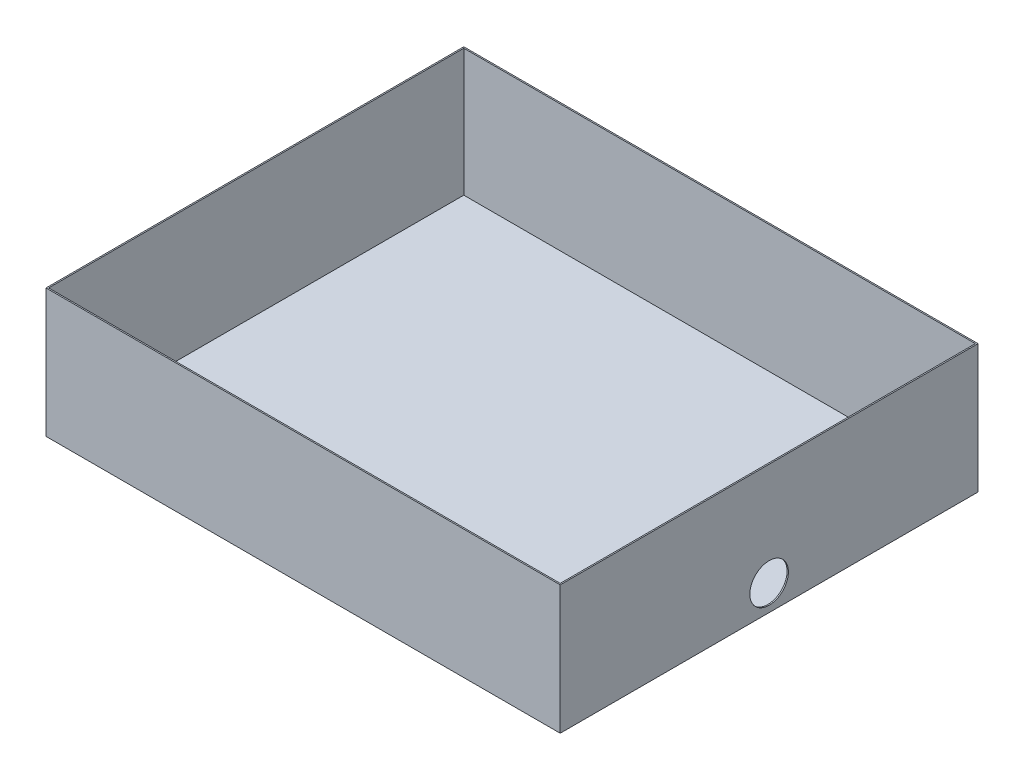
ISO-10303-21;
HEADER;
FILE_DESCRIPTION(('STEP AP214'),'2;1');
FILE_NAME('part.step','',(''),(''),'','','');
FILE_SCHEMA(('AUTOMOTIVE_DESIGN { 1 0 10303 214 1 1 1 1 }'));
ENDSEC;
DATA;
#1=APPLICATION_CONTEXT('core data for automotive mechanical design processes');
#2=APPLICATION_PROTOCOL_DEFINITION('international standard','automotive_design',2000,#1);
#3=PRODUCT_CONTEXT('',#1,'mechanical');
#4=PRODUCT('Part','Part','',(#3));
#5=PRODUCT_RELATED_PRODUCT_CATEGORY('part','',(#4));
#6=PRODUCT_DEFINITION_FORMATION('','',#4);
#7=PRODUCT_DEFINITION_CONTEXT('part definition',#1,'design');
#8=PRODUCT_DEFINITION('design','',#6,#7);
#9=PRODUCT_DEFINITION_SHAPE('','',#8);
#10=(LENGTH_UNIT() NAMED_UNIT(*) SI_UNIT(.MILLI.,.METRE.));
#11=(NAMED_UNIT(*) PLANE_ANGLE_UNIT() SI_UNIT($,.RADIAN.));
#12=(NAMED_UNIT(*) SI_UNIT($,.STERADIAN.) SOLID_ANGLE_UNIT());
#13=UNCERTAINTY_MEASURE_WITH_UNIT(LENGTH_MEASURE(1.E-05),#10,'distance_accuracy_value','');
#14=(GEOMETRIC_REPRESENTATION_CONTEXT(3) GLOBAL_UNCERTAINTY_ASSIGNED_CONTEXT((#13)) GLOBAL_UNIT_ASSIGNED_CONTEXT((#10,
#11,#12)) REPRESENTATION_CONTEXT('',''));
#15=CARTESIAN_POINT('',(0.,0.,0.));
#16=DIRECTION('',(0.,0.,1.));
#17=DIRECTION('',(1.,0.,0.));
#18=AXIS2_PLACEMENT_3D('',#15,#16,#17);
#19=CARTESIAN_POINT('',(0.,200.,0.));
#20=DIRECTION('',(1.,0.,0.));
#21=DIRECTION('',(0.,0.,-1.));
#22=AXIS2_PLACEMENT_3D('',#19,#20,#21);
#23=PLANE('',#22);
#24=DIRECTION('',(0.,0.,1.));
#25=VECTOR('',#24,1.);
#26=CARTESIAN_POINT('',(0.,0.,0.));
#27=LINE('',#26,#25);
#28=CARTESIAN_POINT('',(0.,0.,-650.));
#29=VERTEX_POINT('',#28);
#30=CARTESIAN_POINT('',(0.,0.,0.));
#31=VERTEX_POINT('',#30);
#32=EDGE_CURVE('E161',#29,#31,#27,.T.);
#33=ORIENTED_EDGE('',*,*,#32,.T.);
#34=DIRECTION('',(0.,-1.,0.));
#35=VECTOR('',#34,1.);
#36=CARTESIAN_POINT('',(0.,200.,0.));
#37=LINE('',#36,#35);
#38=CARTESIAN_POINT('',(0.,200.,0.));
#39=VERTEX_POINT('',#38);
#40=EDGE_CURVE('E11',#39,#31,#37,.T.);
#41=ORIENTED_EDGE('',*,*,#40,.F.);
#42=DIRECTION('',(0.,0.,1.));
#43=VECTOR('',#42,1.);
#44=CARTESIAN_POINT('',(0.,200.,0.));
#45=LINE('',#44,#43);
#46=CARTESIAN_POINT('',(0.,200.,-650.));
#47=VERTEX_POINT('',#46);
#48=EDGE_CURVE('E167',#47,#39,#45,.T.);
#49=ORIENTED_EDGE('',*,*,#48,.F.);
#50=DIRECTION('',(0.,-1.,0.));
#51=VECTOR('',#50,1.);
#52=CARTESIAN_POINT('',(0.,200.,-650.));
#53=LINE('',#52,#51);
#54=EDGE_CURVE('E177',#47,#29,#53,.T.);
#55=ORIENTED_EDGE('',*,*,#54,.T.);
#56=EDGE_LOOP('',(#33,#41,#49,#55));
#57=FACE_BOUND('',#56,.T.);
#58=ADVANCED_FACE('F39',(#57),#23,.F.);
#59=CARTESIAN_POINT('',(0.,200.,0.));
#60=DIRECTION('',(0.,0.,-1.));
#61=DIRECTION('',(-1.,0.,0.));
#62=AXIS2_PLACEMENT_3D('',#59,#60,#61);
#63=PLANE('',#62);
#64=DIRECTION('',(1.,0.,0.));
#65=VECTOR('',#64,1.);
#66=CARTESIAN_POINT('',(0.,0.,0.));
#67=LINE('',#66,#65);
#68=CARTESIAN_POINT('',(800.,0.,0.));
#69=VERTEX_POINT('',#68);
#70=EDGE_CURVE('E181',#31,#69,#67,.T.);
#71=ORIENTED_EDGE('',*,*,#70,.T.);
#72=DIRECTION('',(0.,-1.,0.));
#73=VECTOR('',#72,1.);
#74=CARTESIAN_POINT('',(800.,200.,0.));
#75=LINE('',#74,#73);
#76=CARTESIAN_POINT('',(800.,200.,0.));
#77=VERTEX_POINT('',#76);
#78=EDGE_CURVE('E47',#77,#69,#75,.T.);
#79=ORIENTED_EDGE('',*,*,#78,.F.);
#80=DIRECTION('',(1.,0.,0.));
#81=VECTOR('',#80,1.);
#82=CARTESIAN_POINT('',(0.,200.,0.));
#83=LINE('',#82,#81);
#84=EDGE_CURVE('E91',#39,#77,#83,.T.);
#85=ORIENTED_EDGE('',*,*,#84,.F.);
#86=ORIENTED_EDGE('',*,*,#40,.T.);
#87=EDGE_LOOP('',(#71,#79,#85,#86));
#88=FACE_BOUND('',#87,.T.);
#89=ADVANCED_FACE('F216',(#88),#63,.F.);
#90=CARTESIAN_POINT('',(800.,200.,0.));
#91=DIRECTION('',(-1.,0.,0.));
#92=DIRECTION('',(0.,0.,1.));
#93=AXIS2_PLACEMENT_3D('',#90,#91,#92);
#94=PLANE('',#93);
#95=CARTESIAN_POINT('',(800.,40.,-325.));
#96=DIRECTION('',(1.,0.,0.));
#97=DIRECTION('',(0.,0.,-1.));
#98=AXIS2_PLACEMENT_3D('',#95,#96,#97);
#99=CIRCLE('',#98,30.);
#100=CARTESIAN_POINT('',(800.,40.,-355.));
#101=VERTEX_POINT('',#100);
#102=EDGE_CURVE('E311',#101,#101,#99,.T.);
#103=ORIENTED_EDGE('',*,*,#102,.F.);
#104=EDGE_LOOP('',(#103));
#105=FACE_BOUND('',#104,.T.);
#106=DIRECTION('',(0.,0.,-1.));
#107=VECTOR('',#106,1.);
#108=CARTESIAN_POINT('',(800.,0.,0.));
#109=LINE('',#108,#107);
#110=CARTESIAN_POINT('',(800.,0.,-650.));
#111=VERTEX_POINT('',#110);
#112=EDGE_CURVE('E184',#69,#111,#109,.T.);
#113=ORIENTED_EDGE('',*,*,#112,.T.);
#114=DIRECTION('',(0.,-1.,0.));
#115=VECTOR('',#114,1.);
#116=CARTESIAN_POINT('',(800.,200.,-650.));
#117=LINE('',#116,#115);
#118=CARTESIAN_POINT('',(800.,200.,-650.));
#119=VERTEX_POINT('',#118);
#120=EDGE_CURVE('E191',#119,#111,#117,.T.);
#121=ORIENTED_EDGE('',*,*,#120,.F.);
#122=DIRECTION('',(0.,0.,-1.));
#123=VECTOR('',#122,1.);
#124=CARTESIAN_POINT('',(800.,200.,0.));
#125=LINE('',#124,#123);
#126=EDGE_CURVE('E172',#77,#119,#125,.T.);
#127=ORIENTED_EDGE('',*,*,#126,.F.);
#128=ORIENTED_EDGE('',*,*,#78,.T.);
#129=EDGE_LOOP('',(#113,#121,#127,#128));
#130=FACE_BOUND('',#129,.T.);
#131=ADVANCED_FACE('F198',(#105,#130),#94,.F.);
#132=CARTESIAN_POINT('',(0.,200.,-650.));
#133=DIRECTION('',(0.,0.,1.));
#134=DIRECTION('',(1.,0.,0.));
#135=AXIS2_PLACEMENT_3D('',#132,#133,#134);
#136=PLANE('',#135);
#137=DIRECTION('',(-1.,0.,0.));
#138=VECTOR('',#137,1.);
#139=CARTESIAN_POINT('',(0.,0.,-650.));
#140=LINE('',#139,#138);
#141=EDGE_CURVE('E84',#111,#29,#140,.T.);
#142=ORIENTED_EDGE('',*,*,#141,.T.);
#143=ORIENTED_EDGE('',*,*,#54,.F.);
#144=DIRECTION('',(-1.,0.,0.));
#145=VECTOR('',#144,1.);
#146=CARTESIAN_POINT('',(0.,200.,-650.));
#147=LINE('',#146,#145);
#148=EDGE_CURVE('E63',#119,#47,#147,.T.);
#149=ORIENTED_EDGE('',*,*,#148,.F.);
#150=ORIENTED_EDGE('',*,*,#120,.T.);
#151=EDGE_LOOP('',(#142,#143,#149,#150));
#152=FACE_BOUND('',#151,.T.);
#153=ADVANCED_FACE('F206',(#152),#136,.F.);
#154=CARTESIAN_POINT('',(0.,200.,0.));
#155=DIRECTION('',(0.,-1.,0.));
#156=DIRECTION('',(0.,0.,-1.));
#157=AXIS2_PLACEMENT_3D('',#154,#155,#156);
#158=PLANE('',#157);
#159=DIRECTION('',(-1.,0.,0.));
#160=VECTOR('',#159,1.);
#161=CARTESIAN_POINT('',(798.,200.,-648.));
#162=LINE('',#161,#160);
#163=CARTESIAN_POINT('',(798.,200.,-648.));
#164=VERTEX_POINT('',#163);
#165=CARTESIAN_POINT('',(2.,200.,-648.));
#166=VERTEX_POINT('',#165);
#167=EDGE_CURVE('E152',#164,#166,#162,.T.);
#168=ORIENTED_EDGE('',*,*,#167,.F.);
#169=DIRECTION('',(0.,0.,-1.));
#170=VECTOR('',#169,1.);
#171=CARTESIAN_POINT('',(798.,200.,-2.));
#172=LINE('',#171,#170);
#173=CARTESIAN_POINT('',(798.,200.,-2.));
#174=VERTEX_POINT('',#173);
#175=EDGE_CURVE('E54',#174,#164,#172,.T.);
#176=ORIENTED_EDGE('',*,*,#175,.F.);
#177=DIRECTION('',(1.,0.,0.));
#178=VECTOR('',#177,1.);
#179=CARTESIAN_POINT('',(798.,200.,-2.));
#180=LINE('',#179,#178);
#181=CARTESIAN_POINT('',(2.,200.,-1.9999999999999));
#182=VERTEX_POINT('',#181);
#183=EDGE_CURVE('E136',#182,#174,#180,.T.);
#184=ORIENTED_EDGE('',*,*,#183,.F.);
#185=DIRECTION('',(0.,0.,1.));
#186=VECTOR('',#185,1.);
#187=CARTESIAN_POINT('',(2.,200.,-1.9999999999999));
#188=LINE('',#187,#186);
#189=EDGE_CURVE('E140',#166,#182,#188,.T.);
#190=ORIENTED_EDGE('',*,*,#189,.F.);
#191=EDGE_LOOP('',(#168,#176,#184,#190));
#192=FACE_BOUND('',#191,.T.);
#193=ORIENTED_EDGE('',*,*,#48,.T.);
#194=ORIENTED_EDGE('',*,*,#84,.T.);
#195=ORIENTED_EDGE('',*,*,#126,.T.);
#196=ORIENTED_EDGE('',*,*,#148,.T.);
#197=EDGE_LOOP('',(#193,#194,#195,#196));
#198=FACE_BOUND('',#197,.T.);
#199=ADVANCED_FACE('F208',(#192,#198),#158,.F.);
#200=CARTESIAN_POINT('',(0.,0.,0.));
#201=DIRECTION('',(0.,-1.,0.));
#202=DIRECTION('',(0.,0.,-1.));
#203=AXIS2_PLACEMENT_3D('',#200,#201,#202);
#204=PLANE('',#203);
#205=ORIENTED_EDGE('',*,*,#32,.F.);
#206=ORIENTED_EDGE('',*,*,#141,.F.);
#207=ORIENTED_EDGE('',*,*,#112,.F.);
#208=ORIENTED_EDGE('',*,*,#70,.F.);
#209=EDGE_LOOP('',(#205,#206,#207,#208));
#210=FACE_BOUND('',#209,.T.);
#211=ADVANCED_FACE('F202',(#210),#204,.T.);
#212=CARTESIAN_POINT('',(798.,2.,-2.));
#213=DIRECTION('',(1.,0.,0.));
#214=DIRECTION('',(0.,0.,-1.));
#215=AXIS2_PLACEMENT_3D('',#212,#213,#214);
#216=PLANE('',#215);
#217=CARTESIAN_POINT('',(798.,40.,-325.));
#218=DIRECTION('',(1.,0.,0.));
#219=DIRECTION('',(0.,0.,-1.));
#220=AXIS2_PLACEMENT_3D('',#217,#218,#219);
#221=CIRCLE('',#220,30.);
#222=CARTESIAN_POINT('',(798.,40.,-355.));
#223=VERTEX_POINT('',#222);
#224=EDGE_CURVE('E143',#223,#223,#221,.F.);
#225=ORIENTED_EDGE('',*,*,#224,.F.);
#226=EDGE_LOOP('',(#225));
#227=FACE_BOUND('',#226,.T.);
#228=ORIENTED_EDGE('',*,*,#175,.T.);
#229=DIRECTION('',(0.,1.,0.));
#230=VECTOR('',#229,1.);
#231=CARTESIAN_POINT('',(798.,2.,-648.));
#232=LINE('',#231,#230);
#233=CARTESIAN_POINT('',(798.,2.,-648.));
#234=VERTEX_POINT('',#233);
#235=EDGE_CURVE('E111',#234,#164,#232,.T.);
#236=ORIENTED_EDGE('',*,*,#235,.F.);
#237=DIRECTION('',(0.,0.,-1.));
#238=VECTOR('',#237,1.);
#239=CARTESIAN_POINT('',(798.,2.,-2.));
#240=LINE('',#239,#238);
#241=CARTESIAN_POINT('',(798.,2.,-2.));
#242=VERTEX_POINT('',#241);
#243=EDGE_CURVE('E115',#242,#234,#240,.T.);
#244=ORIENTED_EDGE('',*,*,#243,.F.);
#245=DIRECTION('',(0.,1.,0.));
#246=VECTOR('',#245,1.);
#247=CARTESIAN_POINT('',(798.,2.,-2.));
#248=LINE('',#247,#246);
#249=EDGE_CURVE('E158',#242,#174,#248,.T.);
#250=ORIENTED_EDGE('',*,*,#249,.T.);
#251=EDGE_LOOP('',(#228,#236,#244,#250));
#252=FACE_BOUND('',#251,.T.);
#253=ADVANCED_FACE('F113',(#227,#252),#216,.F.);
#254=CARTESIAN_POINT('',(798.,2.,-2.));
#255=DIRECTION('',(0.,0.,1.));
#256=DIRECTION('',(1.,0.,0.));
#257=AXIS2_PLACEMENT_3D('',#254,#255,#256);
#258=PLANE('',#257);
#259=ORIENTED_EDGE('',*,*,#183,.T.);
#260=ORIENTED_EDGE('',*,*,#249,.F.);
#261=DIRECTION('',(1.,0.,0.));
#262=VECTOR('',#261,1.);
#263=CARTESIAN_POINT('',(798.,2.,-2.));
#264=LINE('',#263,#262);
#265=CARTESIAN_POINT('',(2.,2.,-1.9999999999999));
#266=VERTEX_POINT('',#265);
#267=EDGE_CURVE('E122',#266,#242,#264,.T.);
#268=ORIENTED_EDGE('',*,*,#267,.F.);
#269=DIRECTION('',(0.,1.,0.));
#270=VECTOR('',#269,1.);
#271=CARTESIAN_POINT('',(2.,2.,-1.9999999999999));
#272=LINE('',#271,#270);
#273=EDGE_CURVE('E162',#266,#182,#272,.T.);
#274=ORIENTED_EDGE('',*,*,#273,.T.);
#275=EDGE_LOOP('',(#259,#260,#268,#274));
#276=FACE_BOUND('',#275,.T.);
#277=ADVANCED_FACE('F245',(#276),#258,.F.);
#278=CARTESIAN_POINT('',(2.,2.,-1.9999999999999));
#279=DIRECTION('',(-1.,0.,0.));
#280=DIRECTION('',(0.,0.,1.));
#281=AXIS2_PLACEMENT_3D('',#278,#279,#280);
#282=PLANE('',#281);
#283=ORIENTED_EDGE('',*,*,#189,.T.);
#284=ORIENTED_EDGE('',*,*,#273,.F.);
#285=DIRECTION('',(0.,0.,1.));
#286=VECTOR('',#285,1.);
#287=CARTESIAN_POINT('',(2.,2.,-1.9999999999999));
#288=LINE('',#287,#286);
#289=CARTESIAN_POINT('',(2.,2.,-648.));
#290=VERTEX_POINT('',#289);
#291=EDGE_CURVE('E131',#290,#266,#288,.T.);
#292=ORIENTED_EDGE('',*,*,#291,.F.);
#293=DIRECTION('',(0.,1.,0.));
#294=VECTOR('',#293,1.);
#295=CARTESIAN_POINT('',(2.,2.,-648.));
#296=LINE('',#295,#294);
#297=EDGE_CURVE('E121',#290,#166,#296,.T.);
#298=ORIENTED_EDGE('',*,*,#297,.T.);
#299=EDGE_LOOP('',(#283,#284,#292,#298));
#300=FACE_BOUND('',#299,.T.);
#301=ADVANCED_FACE('F269',(#300),#282,.F.);
#302=CARTESIAN_POINT('',(798.,2.,-648.));
#303=DIRECTION('',(0.,0.,-1.));
#304=DIRECTION('',(-1.,0.,0.));
#305=AXIS2_PLACEMENT_3D('',#302,#303,#304);
#306=PLANE('',#305);
#307=ORIENTED_EDGE('',*,*,#167,.T.);
#308=ORIENTED_EDGE('',*,*,#297,.F.);
#309=DIRECTION('',(-1.,0.,0.));
#310=VECTOR('',#309,1.);
#311=CARTESIAN_POINT('',(798.,2.,-648.));
#312=LINE('',#311,#310);
#313=EDGE_CURVE('E125',#234,#290,#312,.T.);
#314=ORIENTED_EDGE('',*,*,#313,.F.);
#315=ORIENTED_EDGE('',*,*,#235,.T.);
#316=EDGE_LOOP('',(#307,#308,#314,#315));
#317=FACE_BOUND('',#316,.T.);
#318=ADVANCED_FACE('F126',(#317),#306,.F.);
#319=CARTESIAN_POINT('',(0.,2.,0.));
#320=DIRECTION('',(0.,1.,0.));
#321=DIRECTION('',(0.,0.,1.));
#322=AXIS2_PLACEMENT_3D('',#319,#320,#321);
#323=PLANE('',#322);
#324=ORIENTED_EDGE('',*,*,#243,.T.);
#325=ORIENTED_EDGE('',*,*,#313,.T.);
#326=ORIENTED_EDGE('',*,*,#291,.T.);
#327=ORIENTED_EDGE('',*,*,#267,.T.);
#328=EDGE_LOOP('',(#324,#325,#326,#327));
#329=FACE_BOUND('',#328,.T.);
#330=ADVANCED_FACE('F133',(#329),#323,.T.);
#331=CARTESIAN_POINT('',(-0.00100000000002876,40.,-325.));
#332=DIRECTION('',(1.,0.,0.));
#333=DIRECTION('',(0.,0.,-1.));
#334=AXIS2_PLACEMENT_3D('',#331,#332,#333);
#335=CYLINDRICAL_SURFACE('',#334,30.);
#336=ORIENTED_EDGE('',*,*,#102,.T.);
#337=EDGE_LOOP('',(#336));
#338=FACE_BOUND('',#337,.T.);
#339=ORIENTED_EDGE('',*,*,#224,.T.);
#340=EDGE_LOOP('',(#339));
#341=FACE_BOUND('',#340,.T.);
#342=ADVANCED_FACE('F255',(#338,#341),#335,.F.);
#343=CLOSED_SHELL('',(#58,#89,#131,#153,#199,#211,#253,#277,#301,#318,#330,#342));
#344=MANIFOLD_SOLID_BREP('B2',#343);
#345=ADVANCED_BREP_SHAPE_REPRESENTATION('',(#18,#344),#14);
#346=SHAPE_DEFINITION_REPRESENTATION(#9,#345);
ENDSEC;
END-ISO-10303-21;
